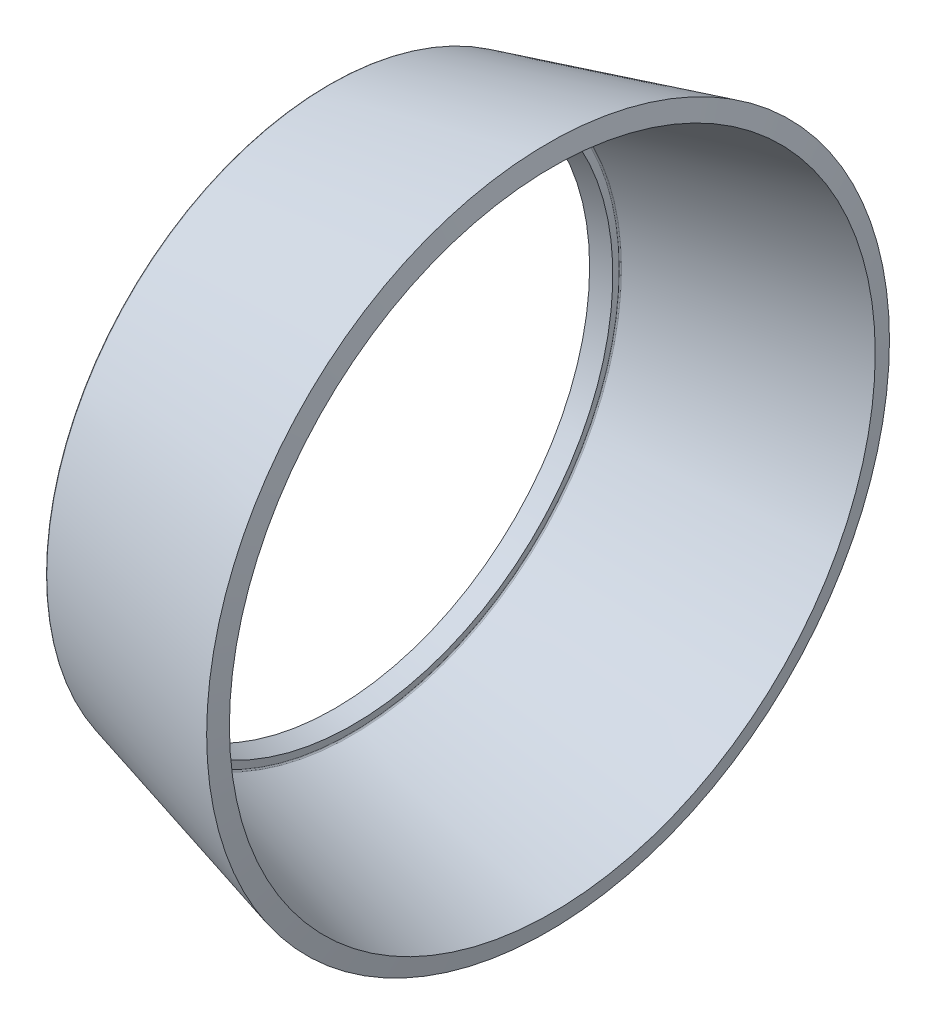
ISO-10303-21;
HEADER;
FILE_DESCRIPTION(('STEP AP214'),'2;1');
FILE_NAME('part.step','',(''),(''),'','','');
FILE_SCHEMA(('AUTOMOTIVE_DESIGN { 1 0 10303 214 1 1 1 1 }'));
ENDSEC;
DATA;
#1=APPLICATION_CONTEXT('core data for automotive mechanical design processes');
#2=APPLICATION_PROTOCOL_DEFINITION('international standard','automotive_design',2000,#1);
#3=PRODUCT_CONTEXT('',#1,'mechanical');
#4=PRODUCT('Part','Part','',(#3));
#5=PRODUCT_RELATED_PRODUCT_CATEGORY('part','',(#4));
#6=PRODUCT_DEFINITION_FORMATION('','',#4);
#7=PRODUCT_DEFINITION_CONTEXT('part definition',#1,'design');
#8=PRODUCT_DEFINITION('design','',#6,#7);
#9=PRODUCT_DEFINITION_SHAPE('','',#8);
#10=(LENGTH_UNIT() NAMED_UNIT(*) SI_UNIT(.MILLI.,.METRE.));
#11=(NAMED_UNIT(*) PLANE_ANGLE_UNIT() SI_UNIT($,.RADIAN.));
#12=(NAMED_UNIT(*) SI_UNIT($,.STERADIAN.) SOLID_ANGLE_UNIT());
#13=UNCERTAINTY_MEASURE_WITH_UNIT(LENGTH_MEASURE(1.E-05),#10,'distance_accuracy_value','');
#14=(GEOMETRIC_REPRESENTATION_CONTEXT(3) GLOBAL_UNCERTAINTY_ASSIGNED_CONTEXT((#13)) GLOBAL_UNIT_ASSIGNED_CONTEXT((#10,
#11,#12)) REPRESENTATION_CONTEXT('',''));
#15=CARTESIAN_POINT('',(0.,0.,0.));
#16=DIRECTION('',(0.,0.,1.));
#17=DIRECTION('',(1.,0.,0.));
#18=AXIS2_PLACEMENT_3D('',#15,#16,#17);
#19=CARTESIAN_POINT('',(11.527418238603,0.,0.));
#20=DIRECTION('',(1.,0.,0.));
#21=DIRECTION('',(0.,0.,1.));
#22=AXIS2_PLACEMENT_3D('',#19,#20,#21);
#23=CONICAL_SURFACE('',#22,18.019845815072,0.261083802805796);
#24=CARTESIAN_POINT('',(0.0202661323712192,0.,0.));
#25=DIRECTION('',(1.,0.,0.));
#26=DIRECTION('',(0.,0.,1.));
#27=AXIS2_PLACEMENT_3D('',#24,#25,#26);
#28=CIRCLE('',#27,14.945337555403);
#29=CARTESIAN_POINT('',(0.0202661323712192,0.,14.945337555403));
#30=VERTEX_POINT('',#29);
#31=EDGE_CURVE('E44',#30,#30,#28,.T.);
#32=ORIENTED_EDGE('',*,*,#31,.T.);
#33=EDGE_LOOP('',(#32));
#34=FACE_BOUND('',#33,.T.);
#35=CARTESIAN_POINT('',(11.527418238603,0.,0.));
#36=DIRECTION('',(-1.,0.,0.));
#37=DIRECTION('',(0.,0.,-1.));
#38=AXIS2_PLACEMENT_3D('',#35,#36,#37);
#39=CIRCLE('',#38,18.019845815072);
#40=CARTESIAN_POINT('',(11.527418238603,0.,-18.019845815072));
#41=VERTEX_POINT('',#40);
#42=EDGE_CURVE('E41',#41,#41,#39,.F.);
#43=ORIENTED_EDGE('',*,*,#42,.F.);
#44=EDGE_LOOP('',(#43));
#45=FACE_BOUND('',#44,.T.);
#46=ADVANCED_FACE('F15',(#34,#45),#23,.T.);
#47=CARTESIAN_POINT('',(0.0460789100578095,0.,0.));
#48=DIRECTION('',(1.,0.,0.));
#49=DIRECTION('',(0.,0.,1.));
#50=AXIS2_PLACEMENT_3D('',#47,#48,#49);
#51=TOROIDAL_SURFACE('',#50,14.8487264768041,0.0999999999996873);
#52=CARTESIAN_POINT('',(-0.051376516477378,0.,0.));
#53=DIRECTION('',(1.,0.,0.));
#54=DIRECTION('',(0.,0.,1.));
#55=AXIS2_PLACEMENT_3D('',#52,#53,#54);
#56=CIRCLE('',#55,14.826311306968);
#57=CARTESIAN_POINT('',(-0.051376516477378,0.,14.826311306968));
#58=VERTEX_POINT('',#57);
#59=EDGE_CURVE('E38',#58,#58,#56,.T.);
#60=ORIENTED_EDGE('',*,*,#59,.T.);
#61=EDGE_LOOP('',(#60));
#62=FACE_BOUND('',#61,.T.);
#63=ORIENTED_EDGE('',*,*,#31,.F.);
#64=EDGE_LOOP('',(#63));
#65=FACE_BOUND('',#64,.T.);
#66=ADVANCED_FACE('F50',(#62,#65),#51,.T.);
#67=CARTESIAN_POINT('',(-0.0513765164773821,0.,0.));
#68=DIRECTION('',(-1.,0.,0.));
#69=DIRECTION('',(0.,0.,-1.));
#70=AXIS2_PLACEMENT_3D('',#67,#68,#69);
#71=CONICAL_SURFACE('',#70,14.826311306968,1.34472382878409);
#72=ORIENTED_EDGE('',*,*,#59,.F.);
#73=EDGE_LOOP('',(#72));
#74=FACE_BOUND('',#73,.T.);
#75=CARTESIAN_POINT('',(0.263413398934618,0.,0.));
#76=DIRECTION('',(1.,0.,0.));
#77=DIRECTION('',(0.,0.,1.));
#78=AXIS2_PLACEMENT_3D('',#75,#76,#77);
#79=CIRCLE('',#78,13.457685251474);
#80=CARTESIAN_POINT('',(0.263413398934618,0.,13.457685251474));
#81=VERTEX_POINT('',#80);
#82=EDGE_CURVE('E35',#81,#81,#79,.T.);
#83=ORIENTED_EDGE('',*,*,#82,.T.);
#84=EDGE_LOOP('',(#83));
#85=FACE_BOUND('',#84,.T.);
#86=ADVANCED_FACE('F52',(#74,#85),#71,.F.);
#87=CARTESIAN_POINT('',(1.2301166126794,0.,0.));
#88=DIRECTION('',(1.,0.,0.));
#89=DIRECTION('',(0.,0.,1.));
#90=AXIS2_PLACEMENT_3D('',#87,#88,#89);
#91=CONICAL_SURFACE('',#90,13.7159713146,0.261083802806117);
#92=CARTESIAN_POINT('',(1.2301166126794,0.,0.));
#93=DIRECTION('',(1.,0.,0.));
#94=DIRECTION('',(0.,0.,1.));
#95=AXIS2_PLACEMENT_3D('',#92,#93,#94);
#96=CIRCLE('',#95,13.7159713146);
#97=CARTESIAN_POINT('',(1.2301166126794,0.,13.7159713146));
#98=VERTEX_POINT('',#97);
#99=EDGE_CURVE('E30',#98,#98,#96,.T.);
#100=ORIENTED_EDGE('',*,*,#99,.T.);
#101=EDGE_LOOP('',(#100));
#102=FACE_BOUND('',#101,.T.);
#103=ORIENTED_EDGE('',*,*,#82,.F.);
#104=EDGE_LOOP('',(#103));
#105=FACE_BOUND('',#104,.T.);
#106=ADVANCED_FACE('F60',(#102,#105),#91,.F.);
#107=CARTESIAN_POINT('',(1.132401244161,0.,0.));
#108=DIRECTION('',(-1.,0.,0.));
#109=DIRECTION('',(0.,0.,-1.));
#110=AXIS2_PLACEMENT_3D('',#107,#108,#109);
#111=CONICAL_SURFACE('',#110,14.140812749566,1.34472382878407);
#112=ORIENTED_EDGE('',*,*,#99,.F.);
#113=EDGE_LOOP('',(#112));
#114=FACE_BOUND('',#113,.T.);
#115=CARTESIAN_POINT('',(1.132401244161,0.,0.));
#116=DIRECTION('',(1.,0.,0.));
#117=DIRECTION('',(0.,0.,1.));
#118=AXIS2_PLACEMENT_3D('',#115,#116,#117);
#119=CIRCLE('',#118,14.140812749566);
#120=CARTESIAN_POINT('',(1.132401244161,0.,14.140812749566));
#121=VERTEX_POINT('',#120);
#122=EDGE_CURVE('E26',#121,#121,#119,.T.);
#123=ORIENTED_EDGE('',*,*,#122,.T.);
#124=EDGE_LOOP('',(#123));
#125=FACE_BOUND('',#124,.T.);
#126=ADVANCED_FACE('F67',(#114,#125),#111,.T.);
#127=CARTESIAN_POINT('',(1.19737152851884,0.,0.));
#128=DIRECTION('',(1.,0.,0.));
#129=DIRECTION('',(0.,0.,1.));
#130=AXIS2_PLACEMENT_3D('',#127,#128,#129);
#131=TOROIDAL_SURFACE('',#130,14.1557561961228,0.0666666666673331);
#132=CARTESIAN_POINT('',(1.18016301006011,0.,0.));
#133=DIRECTION('',(1.,0.,0.));
#134=DIRECTION('',(0.,0.,1.));
#135=AXIS2_PLACEMENT_3D('',#132,#133,#134);
#136=CIRCLE('',#135,14.220163581856);
#137=CARTESIAN_POINT('',(1.18016301006011,0.,14.220163581856));
#138=VERTEX_POINT('',#137);
#139=EDGE_CURVE('E22',#138,#138,#136,.T.);
#140=ORIENTED_EDGE('',*,*,#139,.T.);
#141=EDGE_LOOP('',(#140));
#142=FACE_BOUND('',#141,.T.);
#143=ORIENTED_EDGE('',*,*,#122,.F.);
#144=EDGE_LOOP('',(#143));
#145=FACE_BOUND('',#144,.T.);
#146=ADVANCED_FACE('F71',(#142,#145),#131,.F.);
#147=CARTESIAN_POINT('',(11.751707388783,0.,0.));
#148=DIRECTION('',(1.,0.,0.));
#149=DIRECTION('',(0.,0.,1.));
#150=AXIS2_PLACEMENT_3D('',#147,#148,#149);
#151=CONICAL_SURFACE('',#150,17.044693944346,0.261083802805809);
#152=CARTESIAN_POINT('',(11.751707388783,0.,0.));
#153=DIRECTION('',(1.,0.,0.));
#154=DIRECTION('',(0.,0.,1.));
#155=AXIS2_PLACEMENT_3D('',#152,#153,#154);
#156=CIRCLE('',#155,17.044693944346);
#157=CARTESIAN_POINT('',(11.751707388783,0.,17.044693944346));
#158=VERTEX_POINT('',#157);
#159=EDGE_CURVE('E10',#158,#158,#156,.T.);
#160=ORIENTED_EDGE('',*,*,#159,.T.);
#161=EDGE_LOOP('',(#160));
#162=FACE_BOUND('',#161,.T.);
#163=ORIENTED_EDGE('',*,*,#139,.F.);
#164=EDGE_LOOP('',(#163));
#165=FACE_BOUND('',#164,.T.);
#166=ADVANCED_FACE('F74',(#162,#165),#151,.F.);
#167=CARTESIAN_POINT('',(11.527418238603,0.,0.));
#168=DIRECTION('',(-1.,0.,0.));
#169=DIRECTION('',(0.,0.,-1.));
#170=AXIS2_PLACEMENT_3D('',#167,#168,#169);
#171=CONICAL_SURFACE('',#170,18.019845815072,1.34472382878319);
#172=ORIENTED_EDGE('',*,*,#42,.T.);
#173=EDGE_LOOP('',(#172));
#174=FACE_BOUND('',#173,.T.);
#175=ORIENTED_EDGE('',*,*,#159,.F.);
#176=EDGE_LOOP('',(#175));
#177=FACE_BOUND('',#176,.T.);
#178=ADVANCED_FACE('F17',(#174,#177),#171,.T.);
#179=CLOSED_SHELL('',(#46,#66,#86,#106,#126,#146,#166,#178));
#180=MANIFOLD_SOLID_BREP('B1',#179);
#181=ADVANCED_BREP_SHAPE_REPRESENTATION('',(#18,#180),#14);
#182=SHAPE_DEFINITION_REPRESENTATION(#9,#181);
ENDSEC;
END-ISO-10303-21;
